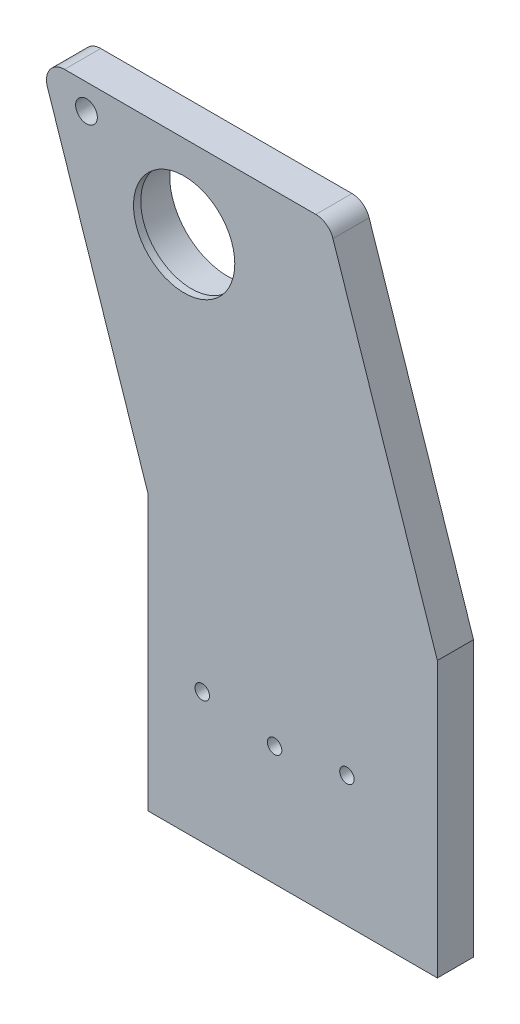
ISO-10303-21;
HEADER;
FILE_DESCRIPTION(('STEP AP214'),'2;1');
FILE_NAME('part.step','',(''),(''),'','','');
FILE_SCHEMA(('AUTOMOTIVE_DESIGN { 1 0 10303 214 1 1 1 1 }'));
ENDSEC;
DATA;
#1=APPLICATION_CONTEXT('core data for automotive mechanical design processes');
#2=APPLICATION_PROTOCOL_DEFINITION('international standard','automotive_design',2000,#1);
#3=PRODUCT_CONTEXT('',#1,'mechanical');
#4=PRODUCT('Part','Part','',(#3));
#5=PRODUCT_RELATED_PRODUCT_CATEGORY('part','',(#4));
#6=PRODUCT_DEFINITION_FORMATION('','',#4);
#7=PRODUCT_DEFINITION_CONTEXT('part definition',#1,'design');
#8=PRODUCT_DEFINITION('design','',#6,#7);
#9=PRODUCT_DEFINITION_SHAPE('','',#8);
#10=(LENGTH_UNIT() NAMED_UNIT(*) SI_UNIT(.MILLI.,.METRE.));
#11=(NAMED_UNIT(*) PLANE_ANGLE_UNIT() SI_UNIT($,.RADIAN.));
#12=(NAMED_UNIT(*) SI_UNIT($,.STERADIAN.) SOLID_ANGLE_UNIT());
#13=UNCERTAINTY_MEASURE_WITH_UNIT(LENGTH_MEASURE(1.E-05),#10,'distance_accuracy_value','');
#14=(GEOMETRIC_REPRESENTATION_CONTEXT(3) GLOBAL_UNCERTAINTY_ASSIGNED_CONTEXT((#13)) GLOBAL_UNIT_ASSIGNED_CONTEXT((#10,
#11,#12)) REPRESENTATION_CONTEXT('',''));
#15=CARTESIAN_POINT('',(0.,0.,0.));
#16=DIRECTION('',(0.,0.,1.));
#17=DIRECTION('',(1.,0.,0.));
#18=AXIS2_PLACEMENT_3D('',#15,#16,#17);
#19=CARTESIAN_POINT('',(-30.,60.,10.));
#20=DIRECTION('',(0.,0.,-1.));
#21=DIRECTION('',(-1.,0.,0.));
#22=AXIS2_PLACEMENT_3D('',#19,#20,#21);
#23=CYLINDRICAL_SURFACE('',#22,16.);
#24=CARTESIAN_POINT('',(-30.,60.,-2.));
#25=DIRECTION('',(0.,0.,1.));
#26=DIRECTION('',(1.,0.,0.));
#27=AXIS2_PLACEMENT_3D('',#24,#25,#26);
#28=CIRCLE('',#27,16.);
#29=CARTESIAN_POINT('',(-14.,60.,-2.));
#30=VERTEX_POINT('',#29);
#31=EDGE_CURVE('E187',#30,#30,#28,.T.);
#32=ORIENTED_EDGE('',*,*,#31,.F.);
#33=EDGE_LOOP('',(#32));
#34=FACE_BOUND('',#33,.T.);
#35=CARTESIAN_POINT('',(-30.,60.,8.));
#36=DIRECTION('',(0.,0.,1.));
#37=DIRECTION('',(1.,0.,0.));
#38=AXIS2_PLACEMENT_3D('',#35,#36,#37);
#39=CIRCLE('',#38,16.);
#40=CARTESIAN_POINT('',(-14.,60.,8.));
#41=VERTEX_POINT('',#40);
#42=EDGE_CURVE('E214',#41,#41,#39,.T.);
#43=ORIENTED_EDGE('',*,*,#42,.T.);
#44=EDGE_LOOP('',(#43));
#45=FACE_BOUND('',#44,.T.);
#46=ADVANCED_FACE('F36',(#34,#45),#23,.F.);
#47=CARTESIAN_POINT('',(0.,0.,10.));
#48=DIRECTION('',(0.,0.,-1.));
#49=DIRECTION('',(-1.,0.,0.));
#50=AXIS2_PLACEMENT_3D('',#47,#48,#49);
#51=PLANE('',#50);
#52=CARTESIAN_POINT('',(-5.00000000000003,-49.9999999999999,10.));
#53=DIRECTION('',(0.,0.,-1.));
#54=DIRECTION('',(-1.,0.,0.));
#55=AXIS2_PLACEMENT_3D('',#52,#53,#54);
#56=CIRCLE('',#55,2.);
#57=CARTESIAN_POINT('',(-7.00000000000003,-49.9999999999999,10.));
#58=VERTEX_POINT('',#57);
#59=EDGE_CURVE('E206',#58,#58,#56,.F.);
#60=ORIENTED_EDGE('',*,*,#59,.F.);
#61=EDGE_LOOP('',(#60));
#62=FACE_BOUND('',#61,.T.);
#63=CARTESIAN_POINT('',(-57.,76.,10.));
#64=DIRECTION('',(0.,0.,1.));
#65=DIRECTION('',(1.,0.,0.));
#66=AXIS2_PLACEMENT_3D('',#63,#64,#65);
#67=CIRCLE('',#66,3.);
#68=CARTESIAN_POINT('',(-54.,76.,10.));
#69=VERTEX_POINT('',#68);
#70=EDGE_CURVE('E195',#69,#69,#67,.T.);
#71=ORIENTED_EDGE('',*,*,#70,.F.);
#72=EDGE_LOOP('',(#71));
#73=FACE_BOUND('',#72,.T.);
#74=CARTESIAN_POINT('',(-25.,-47.,10.));
#75=DIRECTION('',(0.,0.,1.));
#76=DIRECTION('',(1.,0.,0.));
#77=AXIS2_PLACEMENT_3D('',#74,#75,#76);
#78=CIRCLE('',#77,2.);
#79=CARTESIAN_POINT('',(-23.,-47.,10.));
#80=VERTEX_POINT('',#79);
#81=EDGE_CURVE('E198',#80,#80,#78,.T.);
#82=ORIENTED_EDGE('',*,*,#81,.F.);
#83=EDGE_LOOP('',(#82));
#84=FACE_BOUND('',#83,.T.);
#85=CARTESIAN_POINT('',(15.,-47.,10.));
#86=DIRECTION('',(0.,0.,1.));
#87=DIRECTION('',(1.,0.,0.));
#88=AXIS2_PLACEMENT_3D('',#85,#86,#87);
#89=CIRCLE('',#88,2.);
#90=CARTESIAN_POINT('',(17.,-47.,10.));
#91=VERTEX_POINT('',#90);
#92=EDGE_CURVE('E191',#91,#91,#89,.T.);
#93=ORIENTED_EDGE('',*,*,#92,.F.);
#94=EDGE_LOOP('',(#93));
#95=FACE_BOUND('',#94,.T.);
#96=DIRECTION('',(-0.316227766016838,0.948683298050514,0.));
#97=VECTOR('',#96,1.);
#98=CARTESIAN_POINT('',(9.99999999999998,83.,10.));
#99=LINE('',#98,#97);
#100=CARTESIAN_POINT('',(40.,-7.00000000000001,10.));
#101=VERTEX_POINT('',#100);
#102=CARTESIAN_POINT('',(11.1396203899719,79.5811388300842,10.));
#103=VERTEX_POINT('',#102);
#104=EDGE_CURVE('E149',#101,#103,#99,.T.);
#105=ORIENTED_EDGE('',*,*,#104,.T.);
#106=CARTESIAN_POINT('',(6.39620389971937,78.,10.));
#107=DIRECTION('',(0.,0.,-1.));
#108=DIRECTION('',(-1.,0.,0.));
#109=AXIS2_PLACEMENT_3D('',#106,#107,#108);
#110=CIRCLE('',#109,5.);
#111=CARTESIAN_POINT('',(6.39620389971937,83.,10.));
#112=VERTEX_POINT('',#111);
#113=EDGE_CURVE('E44',#103,#112,#110,.F.);
#114=ORIENTED_EDGE('',*,*,#113,.T.);
#115=DIRECTION('',(-1.,0.,0.));
#116=VECTOR('',#115,1.);
#117=CARTESIAN_POINT('',(9.99999999999998,83.,10.));
#118=LINE('',#117,#116);
#119=CARTESIAN_POINT('',(-63.062870566386,83.,10.));
#120=VERTEX_POINT('',#119);
#121=EDGE_CURVE('E148',#112,#120,#118,.T.);
#122=ORIENTED_EDGE('',*,*,#121,.T.);
#123=CARTESIAN_POINT('',(-63.062870566386,78.,10.));
#124=DIRECTION('',(0.,0.,-1.));
#125=DIRECTION('',(-1.,0.,0.));
#126=AXIS2_PLACEMENT_3D('',#123,#124,#125);
#127=CIRCLE('',#126,5.);
#128=CARTESIAN_POINT('',(-67.8062870566386,76.4188611699158,10.));
#129=VERTEX_POINT('',#128);
#130=EDGE_CURVE('E51',#120,#129,#127,.F.);
#131=ORIENTED_EDGE('',*,*,#130,.T.);
#132=DIRECTION('',(0.316227766016838,-0.948683298050514,0.));
#133=VECTOR('',#132,1.);
#134=CARTESIAN_POINT('',(-70.,83.,10.));
#135=LINE('',#134,#133);
#136=CARTESIAN_POINT('',(-40.,-7.00000000000001,9.99999999999999));
#137=VERTEX_POINT('',#136);
#138=EDGE_CURVE('E119',#129,#137,#135,.T.);
#139=ORIENTED_EDGE('',*,*,#138,.T.);
#140=DIRECTION('',(0.,-1.,0.));
#141=VECTOR('',#140,1.);
#142=CARTESIAN_POINT('',(-40.,-7.00000000000001,9.99999999999999));
#143=LINE('',#142,#141);
#144=CARTESIAN_POINT('',(-40.,-83.,9.99999999999999));
#145=VERTEX_POINT('',#144);
#146=EDGE_CURVE('E114',#137,#145,#143,.T.);
#147=ORIENTED_EDGE('',*,*,#146,.T.);
#148=DIRECTION('',(1.,0.,0.));
#149=VECTOR('',#148,1.);
#150=CARTESIAN_POINT('',(40.,-83.,10.));
#151=LINE('',#150,#149);
#152=CARTESIAN_POINT('',(40.,-83.,10.));
#153=VERTEX_POINT('',#152);
#154=EDGE_CURVE('E104',#145,#153,#151,.T.);
#155=ORIENTED_EDGE('',*,*,#154,.T.);
#156=DIRECTION('',(0.,1.,0.));
#157=VECTOR('',#156,1.);
#158=CARTESIAN_POINT('',(40.,-7.00000000000001,10.));
#159=LINE('',#158,#157);
#160=EDGE_CURVE('E113',#153,#101,#159,.T.);
#161=ORIENTED_EDGE('',*,*,#160,.T.);
#162=EDGE_LOOP('',(#105,#114,#122,#131,#139,#147,#155,#161));
#163=FACE_BOUND('',#162,.T.);
#164=CARTESIAN_POINT('',(-30.,60.,10.));
#165=DIRECTION('',(0.,0.,1.));
#166=DIRECTION('',(1.,0.,0.));
#167=AXIS2_PLACEMENT_3D('',#164,#165,#166);
#168=CIRCLE('',#167,14.);
#169=CARTESIAN_POINT('',(-16.,60.,10.));
#170=VERTEX_POINT('',#169);
#171=EDGE_CURVE('E217',#170,#170,#168,.T.);
#172=ORIENTED_EDGE('',*,*,#171,.F.);
#173=EDGE_LOOP('',(#172));
#174=FACE_BOUND('',#173,.T.);
#175=ADVANCED_FACE('F117',(#62,#73,#84,#95,#163,#174),#51,.F.);
#176=CARTESIAN_POINT('',(0.,0.,0.));
#177=DIRECTION('',(0.,0.,-1.));
#178=DIRECTION('',(-1.,0.,0.));
#179=AXIS2_PLACEMENT_3D('',#176,#177,#178);
#180=PLANE('',#179);
#181=CARTESIAN_POINT('',(-5.00000000000003,-49.9999999999999,0.));
#182=DIRECTION('',(0.,0.,-1.));
#183=DIRECTION('',(-1.,0.,0.));
#184=AXIS2_PLACEMENT_3D('',#181,#182,#183);
#185=CIRCLE('',#184,2.);
#186=CARTESIAN_POINT('',(-7.00000000000003,-49.9999999999999,0.));
#187=VERTEX_POINT('',#186);
#188=EDGE_CURVE('E211',#187,#187,#185,.T.);
#189=ORIENTED_EDGE('',*,*,#188,.F.);
#190=EDGE_LOOP('',(#189));
#191=FACE_BOUND('',#190,.T.);
#192=CARTESIAN_POINT('',(-57.,76.,0.));
#193=DIRECTION('',(0.,0.,-1.));
#194=DIRECTION('',(-1.,0.,0.));
#195=AXIS2_PLACEMENT_3D('',#192,#193,#194);
#196=CIRCLE('',#195,3.);
#197=CARTESIAN_POINT('',(-60.,76.,0.));
#198=VERTEX_POINT('',#197);
#199=EDGE_CURVE('E203',#198,#198,#196,.F.);
#200=ORIENTED_EDGE('',*,*,#199,.T.);
#201=EDGE_LOOP('',(#200));
#202=FACE_BOUND('',#201,.T.);
#203=CARTESIAN_POINT('',(-25.,-47.,0.));
#204=DIRECTION('',(0.,0.,1.));
#205=DIRECTION('',(1.,0.,0.));
#206=AXIS2_PLACEMENT_3D('',#203,#204,#205);
#207=CIRCLE('',#206,2.);
#208=CARTESIAN_POINT('',(-23.,-47.,0.));
#209=VERTEX_POINT('',#208);
#210=EDGE_CURVE('E190',#209,#209,#207,.T.);
#211=ORIENTED_EDGE('',*,*,#210,.T.);
#212=EDGE_LOOP('',(#211));
#213=FACE_BOUND('',#212,.T.);
#214=CARTESIAN_POINT('',(15.,-47.,0.));
#215=DIRECTION('',(0.,0.,1.));
#216=DIRECTION('',(1.,0.,0.));
#217=AXIS2_PLACEMENT_3D('',#214,#215,#216);
#218=CIRCLE('',#217,2.);
#219=CARTESIAN_POINT('',(17.,-47.,0.));
#220=VERTEX_POINT('',#219);
#221=EDGE_CURVE('E194',#220,#220,#218,.T.);
#222=ORIENTED_EDGE('',*,*,#221,.T.);
#223=EDGE_LOOP('',(#222));
#224=FACE_BOUND('',#223,.T.);
#225=CARTESIAN_POINT('',(-30.,60.,0.));
#226=DIRECTION('',(0.,0.,-1.));
#227=DIRECTION('',(-1.,0.,0.));
#228=AXIS2_PLACEMENT_3D('',#225,#226,#227);
#229=CIRCLE('',#228,18.);
#230=CARTESIAN_POINT('',(-48.,60.,0.));
#231=VERTEX_POINT('',#230);
#232=EDGE_CURVE('E128',#231,#231,#229,.T.);
#233=ORIENTED_EDGE('',*,*,#232,.F.);
#234=EDGE_LOOP('',(#233));
#235=FACE_BOUND('',#234,.T.);
#236=DIRECTION('',(-1.,0.,0.));
#237=VECTOR('',#236,1.);
#238=CARTESIAN_POINT('',(-40.,83.,0.));
#239=LINE('',#238,#237);
#240=CARTESIAN_POINT('',(6.39620389971937,83.,0.));
#241=VERTEX_POINT('',#240);
#242=CARTESIAN_POINT('',(-63.062870566386,83.,0.));
#243=VERTEX_POINT('',#242);
#244=EDGE_CURVE('E164',#241,#243,#239,.T.);
#245=ORIENTED_EDGE('',*,*,#244,.F.);
#246=CARTESIAN_POINT('',(6.39620389971937,78.,0.));
#247=DIRECTION('',(0.,0.,-1.));
#248=DIRECTION('',(-1.,0.,0.));
#249=AXIS2_PLACEMENT_3D('',#246,#247,#248);
#250=CIRCLE('',#249,5.);
#251=CARTESIAN_POINT('',(11.1396203899719,79.5811388300842,0.));
#252=VERTEX_POINT('',#251);
#253=EDGE_CURVE('E143',#241,#252,#250,.T.);
#254=ORIENTED_EDGE('',*,*,#253,.T.);
#255=DIRECTION('',(-0.316227766016838,0.948683298050514,0.));
#256=VECTOR('',#255,1.);
#257=CARTESIAN_POINT('',(9.99999999999998,83.,0.));
#258=LINE('',#257,#256);
#259=CARTESIAN_POINT('',(40.,-7.00000000000001,0.));
#260=VERTEX_POINT('',#259);
#261=EDGE_CURVE('E163',#260,#252,#258,.T.);
#262=ORIENTED_EDGE('',*,*,#261,.F.);
#263=DIRECTION('',(0.,1.,0.));
#264=VECTOR('',#263,1.);
#265=CARTESIAN_POINT('',(40.,-7.00000000000001,0.));
#266=LINE('',#265,#264);
#267=CARTESIAN_POINT('',(40.,-83.,0.));
#268=VERTEX_POINT('',#267);
#269=EDGE_CURVE('E168',#268,#260,#266,.T.);
#270=ORIENTED_EDGE('',*,*,#269,.F.);
#271=DIRECTION('',(1.,0.,0.));
#272=VECTOR('',#271,1.);
#273=CARTESIAN_POINT('',(40.,-83.,0.));
#274=LINE('',#273,#272);
#275=CARTESIAN_POINT('',(-40.,-83.,0.));
#276=VERTEX_POINT('',#275);
#277=EDGE_CURVE('E171',#276,#268,#274,.T.);
#278=ORIENTED_EDGE('',*,*,#277,.F.);
#279=DIRECTION('',(0.,-1.,0.));
#280=VECTOR('',#279,1.);
#281=CARTESIAN_POINT('',(-40.,-7.00000000000001,0.));
#282=LINE('',#281,#280);
#283=CARTESIAN_POINT('',(-40.,-7.00000000000001,0.));
#284=VERTEX_POINT('',#283);
#285=EDGE_CURVE('E127',#284,#276,#282,.T.);
#286=ORIENTED_EDGE('',*,*,#285,.F.);
#287=DIRECTION('',(0.316227766016838,-0.948683298050514,0.));
#288=VECTOR('',#287,1.);
#289=CARTESIAN_POINT('',(-70.,83.,0.));
#290=LINE('',#289,#288);
#291=CARTESIAN_POINT('',(-67.8062870566386,76.4188611699158,0.));
#292=VERTEX_POINT('',#291);
#293=EDGE_CURVE('E123',#292,#284,#290,.T.);
#294=ORIENTED_EDGE('',*,*,#293,.F.);
#295=CARTESIAN_POINT('',(-63.062870566386,78.,0.));
#296=DIRECTION('',(0.,0.,-1.));
#297=DIRECTION('',(-1.,0.,0.));
#298=AXIS2_PLACEMENT_3D('',#295,#296,#297);
#299=CIRCLE('',#298,5.);
#300=EDGE_CURVE('E141',#292,#243,#299,.T.);
#301=ORIENTED_EDGE('',*,*,#300,.T.);
#302=EDGE_LOOP('',(#245,#254,#262,#270,#278,#286,#294,#301));
#303=FACE_BOUND('',#302,.T.);
#304=ADVANCED_FACE('F161',(#191,#202,#213,#224,#235,#303),#180,.T.);
#305=CARTESIAN_POINT('',(-40.,-7.00000000000001,9.99999999999999));
#306=DIRECTION('',(1.,0.,0.));
#307=DIRECTION('',(0.,1.,0.));
#308=AXIS2_PLACEMENT_3D('',#305,#306,#307);
#309=PLANE('',#308);
#310=ORIENTED_EDGE('',*,*,#285,.T.);
#311=DIRECTION('',(0.,0.,-1.));
#312=VECTOR('',#311,1.);
#313=CARTESIAN_POINT('',(-40.,-83.,9.99999999999999));
#314=LINE('',#313,#312);
#315=EDGE_CURVE('E108',#145,#276,#314,.T.);
#316=ORIENTED_EDGE('',*,*,#315,.F.);
#317=ORIENTED_EDGE('',*,*,#146,.F.);
#318=DIRECTION('',(0.,0.,-1.));
#319=VECTOR('',#318,1.);
#320=CARTESIAN_POINT('',(-40.,-7.00000000000001,9.99999999999999));
#321=LINE('',#320,#319);
#322=EDGE_CURVE('E176',#137,#284,#321,.T.);
#323=ORIENTED_EDGE('',*,*,#322,.T.);
#324=EDGE_LOOP('',(#310,#316,#317,#323));
#325=FACE_BOUND('',#324,.T.);
#326=ADVANCED_FACE('F125',(#325),#309,.F.);
#327=CARTESIAN_POINT('',(40.,-83.,10.));
#328=DIRECTION('',(0.,1.,0.));
#329=DIRECTION('',(0.,0.,1.));
#330=AXIS2_PLACEMENT_3D('',#327,#328,#329);
#331=PLANE('',#330);
#332=ORIENTED_EDGE('',*,*,#277,.T.);
#333=DIRECTION('',(0.,0.,-1.));
#334=VECTOR('',#333,1.);
#335=CARTESIAN_POINT('',(40.,-83.,10.));
#336=LINE('',#335,#334);
#337=EDGE_CURVE('E111',#153,#268,#336,.T.);
#338=ORIENTED_EDGE('',*,*,#337,.F.);
#339=ORIENTED_EDGE('',*,*,#154,.F.);
#340=ORIENTED_EDGE('',*,*,#315,.T.);
#341=EDGE_LOOP('',(#332,#338,#339,#340));
#342=FACE_BOUND('',#341,.T.);
#343=ADVANCED_FACE('F106',(#342),#331,.F.);
#344=CARTESIAN_POINT('',(40.,-7.00000000000001,10.));
#345=DIRECTION('',(-1.,0.,0.));
#346=DIRECTION('',(0.,0.,1.));
#347=AXIS2_PLACEMENT_3D('',#344,#345,#346);
#348=PLANE('',#347);
#349=ORIENTED_EDGE('',*,*,#269,.T.);
#350=DIRECTION('',(0.,0.,-1.));
#351=VECTOR('',#350,1.);
#352=CARTESIAN_POINT('',(40.,-7.00000000000001,10.));
#353=LINE('',#352,#351);
#354=EDGE_CURVE('E133',#101,#260,#353,.T.);
#355=ORIENTED_EDGE('',*,*,#354,.F.);
#356=ORIENTED_EDGE('',*,*,#160,.F.);
#357=ORIENTED_EDGE('',*,*,#337,.T.);
#358=EDGE_LOOP('',(#349,#355,#356,#357));
#359=FACE_BOUND('',#358,.T.);
#360=ADVANCED_FACE('F182',(#359),#348,.F.);
#361=CARTESIAN_POINT('',(9.99999999999998,83.,10.));
#362=DIRECTION('',(-0.948683298050514,-0.316227766016838,0.));
#363=DIRECTION('',(0.316227766016838,-0.948683298050514,0.));
#364=AXIS2_PLACEMENT_3D('',#361,#362,#363);
#365=PLANE('',#364);
#366=ORIENTED_EDGE('',*,*,#261,.T.);
#367=DIRECTION('',(0.,0.,-1.));
#368=VECTOR('',#367,1.);
#369=CARTESIAN_POINT('',(11.1396203899719,79.5811388300842,10.));
#370=LINE('',#369,#368);
#371=EDGE_CURVE('E59',#252,#103,#370,.F.);
#372=ORIENTED_EDGE('',*,*,#371,.T.);
#373=ORIENTED_EDGE('',*,*,#104,.F.);
#374=ORIENTED_EDGE('',*,*,#354,.T.);
#375=EDGE_LOOP('',(#366,#372,#373,#374));
#376=FACE_BOUND('',#375,.T.);
#377=ADVANCED_FACE('F166',(#376),#365,.F.);
#378=CARTESIAN_POINT('',(-40.,83.,9.99999999999999));
#379=DIRECTION('',(0.,-1.,0.));
#380=DIRECTION('',(0.,0.,-1.));
#381=AXIS2_PLACEMENT_3D('',#378,#379,#380);
#382=PLANE('',#381);
#383=ORIENTED_EDGE('',*,*,#121,.F.);
#384=DIRECTION('',(0.,0.,-1.));
#385=VECTOR('',#384,1.);
#386=CARTESIAN_POINT('',(6.39620389971937,83.,10.));
#387=LINE('',#386,#385);
#388=EDGE_CURVE('E138',#112,#241,#387,.T.);
#389=ORIENTED_EDGE('',*,*,#388,.T.);
#390=ORIENTED_EDGE('',*,*,#244,.T.);
#391=DIRECTION('',(0.,0.,-1.));
#392=VECTOR('',#391,1.);
#393=CARTESIAN_POINT('',(-63.062870566386,83.,10.));
#394=LINE('',#393,#392);
#395=EDGE_CURVE('E131',#243,#120,#394,.F.);
#396=ORIENTED_EDGE('',*,*,#395,.T.);
#397=EDGE_LOOP('',(#383,#389,#390,#396));
#398=FACE_BOUND('',#397,.T.);
#399=ADVANCED_FACE('F153',(#398),#382,.F.);
#400=CARTESIAN_POINT('',(-70.,83.,10.));
#401=DIRECTION('',(0.948683298050514,0.316227766016838,0.));
#402=DIRECTION('',(-0.316227766016838,0.948683298050514,0.));
#403=AXIS2_PLACEMENT_3D('',#400,#401,#402);
#404=PLANE('',#403);
#405=ORIENTED_EDGE('',*,*,#138,.F.);
#406=DIRECTION('',(0.,0.,-1.));
#407=VECTOR('',#406,1.);
#408=CARTESIAN_POINT('',(-67.8062870566386,76.4188611699158,10.));
#409=LINE('',#408,#407);
#410=EDGE_CURVE('E11',#129,#292,#409,.T.);
#411=ORIENTED_EDGE('',*,*,#410,.T.);
#412=ORIENTED_EDGE('',*,*,#293,.T.);
#413=ORIENTED_EDGE('',*,*,#322,.F.);
#414=EDGE_LOOP('',(#405,#411,#412,#413));
#415=FACE_BOUND('',#414,.T.);
#416=ADVANCED_FACE('F241',(#415),#404,.F.);
#417=CARTESIAN_POINT('',(-30.,60.,-2.));
#418=DIRECTION('',(0.,0.,1.));
#419=DIRECTION('',(1.,0.,0.));
#420=AXIS2_PLACEMENT_3D('',#417,#418,#419);
#421=CYLINDRICAL_SURFACE('',#420,18.);
#422=ORIENTED_EDGE('',*,*,#232,.T.);
#423=EDGE_LOOP('',(#422));
#424=FACE_BOUND('',#423,.T.);
#425=CARTESIAN_POINT('',(-30.,60.,-2.));
#426=DIRECTION('',(0.,0.,1.));
#427=DIRECTION('',(1.,0.,0.));
#428=AXIS2_PLACEMENT_3D('',#425,#426,#427);
#429=CIRCLE('',#428,18.);
#430=CARTESIAN_POINT('',(-12.,60.,-2.));
#431=VERTEX_POINT('',#430);
#432=EDGE_CURVE('E180',#431,#431,#429,.T.);
#433=ORIENTED_EDGE('',*,*,#432,.T.);
#434=EDGE_LOOP('',(#433));
#435=FACE_BOUND('',#434,.T.);
#436=ADVANCED_FACE('F244',(#424,#435),#421,.T.);
#437=CARTESIAN_POINT('',(-30.,60.,-2.));
#438=DIRECTION('',(0.,0.,1.));
#439=DIRECTION('',(1.,0.,0.));
#440=AXIS2_PLACEMENT_3D('',#437,#438,#439);
#441=PLANE('',#440);
#442=ORIENTED_EDGE('',*,*,#31,.T.);
#443=EDGE_LOOP('',(#442));
#444=FACE_BOUND('',#443,.T.);
#445=ORIENTED_EDGE('',*,*,#432,.F.);
#446=EDGE_LOOP('',(#445));
#447=FACE_BOUND('',#446,.T.);
#448=ADVANCED_FACE('F282',(#444,#447),#441,.F.);
#449=CARTESIAN_POINT('',(15.,-47.,0.));
#450=DIRECTION('',(0.,0.,1.));
#451=DIRECTION('',(1.,0.,0.));
#452=AXIS2_PLACEMENT_3D('',#449,#450,#451);
#453=CYLINDRICAL_SURFACE('',#452,2.);
#454=ORIENTED_EDGE('',*,*,#221,.F.);
#455=EDGE_LOOP('',(#454));
#456=FACE_BOUND('',#455,.T.);
#457=ORIENTED_EDGE('',*,*,#92,.T.);
#458=EDGE_LOOP('',(#457));
#459=FACE_BOUND('',#458,.T.);
#460=ADVANCED_FACE('F278',(#456,#459),#453,.F.);
#461=CARTESIAN_POINT('',(-25.,-47.,0.));
#462=DIRECTION('',(0.,0.,1.));
#463=DIRECTION('',(1.,0.,0.));
#464=AXIS2_PLACEMENT_3D('',#461,#462,#463);
#465=CYLINDRICAL_SURFACE('',#464,2.);
#466=ORIENTED_EDGE('',*,*,#210,.F.);
#467=EDGE_LOOP('',(#466));
#468=FACE_BOUND('',#467,.T.);
#469=ORIENTED_EDGE('',*,*,#81,.T.);
#470=EDGE_LOOP('',(#469));
#471=FACE_BOUND('',#470,.T.);
#472=ADVANCED_FACE('F269',(#468,#471),#465,.F.);
#473=CARTESIAN_POINT('',(-57.,76.,-2.00100000000001));
#474=DIRECTION('',(0.,0.,1.));
#475=DIRECTION('',(1.,0.,0.));
#476=AXIS2_PLACEMENT_3D('',#473,#474,#475);
#477=CYLINDRICAL_SURFACE('',#476,3.);
#478=ORIENTED_EDGE('',*,*,#199,.F.);
#479=EDGE_LOOP('',(#478));
#480=FACE_BOUND('',#479,.T.);
#481=ORIENTED_EDGE('',*,*,#70,.T.);
#482=EDGE_LOOP('',(#481));
#483=FACE_BOUND('',#482,.T.);
#484=ADVANCED_FACE('F263',(#480,#483),#477,.F.);
#485=CARTESIAN_POINT('',(-5.00000000000003,-49.9999999999999,10.001));
#486=DIRECTION('',(0.,0.,-1.));
#487=DIRECTION('',(-1.,0.,0.));
#488=AXIS2_PLACEMENT_3D('',#485,#486,#487);
#489=CYLINDRICAL_SURFACE('',#488,2.);
#490=ORIENTED_EDGE('',*,*,#188,.T.);
#491=EDGE_LOOP('',(#490));
#492=FACE_BOUND('',#491,.T.);
#493=ORIENTED_EDGE('',*,*,#59,.T.);
#494=EDGE_LOOP('',(#493));
#495=FACE_BOUND('',#494,.T.);
#496=ADVANCED_FACE('F256',(#492,#495),#489,.F.);
#497=CARTESIAN_POINT('',(6.39620389971937,78.,10.));
#498=DIRECTION('',(0.,0.,-1.));
#499=DIRECTION('',(-1.,0.,0.));
#500=AXIS2_PLACEMENT_3D('',#497,#498,#499);
#501=CYLINDRICAL_SURFACE('',#500,5.);
#502=ORIENTED_EDGE('',*,*,#113,.F.);
#503=ORIENTED_EDGE('',*,*,#371,.F.);
#504=ORIENTED_EDGE('',*,*,#253,.F.);
#505=ORIENTED_EDGE('',*,*,#388,.F.);
#506=EDGE_LOOP('',(#502,#503,#504,#505));
#507=FACE_BOUND('',#506,.T.);
#508=ADVANCED_FACE('F158',(#507),#501,.T.);
#509=CARTESIAN_POINT('',(-63.062870566386,78.,10.));
#510=DIRECTION('',(0.,0.,-1.));
#511=DIRECTION('',(-1.,0.,0.));
#512=AXIS2_PLACEMENT_3D('',#509,#510,#511);
#513=CYLINDRICAL_SURFACE('',#512,5.);
#514=ORIENTED_EDGE('',*,*,#130,.F.);
#515=ORIENTED_EDGE('',*,*,#395,.F.);
#516=ORIENTED_EDGE('',*,*,#300,.F.);
#517=ORIENTED_EDGE('',*,*,#410,.F.);
#518=EDGE_LOOP('',(#514,#515,#516,#517));
#519=FACE_BOUND('',#518,.T.);
#520=ADVANCED_FACE('F38',(#519),#513,.T.);
#521=CARTESIAN_POINT('',(-30.,60.,8.));
#522=DIRECTION('',(0.,0.,1.));
#523=DIRECTION('',(1.,0.,0.));
#524=AXIS2_PLACEMENT_3D('',#521,#522,#523);
#525=PLANE('',#524);
#526=ORIENTED_EDGE('',*,*,#42,.F.);
#527=EDGE_LOOP('',(#526));
#528=FACE_BOUND('',#527,.T.);
#529=CARTESIAN_POINT('',(-30.,60.,8.));
#530=DIRECTION('',(0.,0.,1.));
#531=DIRECTION('',(1.,0.,0.));
#532=AXIS2_PLACEMENT_3D('',#529,#530,#531);
#533=CIRCLE('',#532,14.);
#534=CARTESIAN_POINT('',(-16.,60.,8.));
#535=VERTEX_POINT('',#534);
#536=EDGE_CURVE('E218',#535,#535,#533,.T.);
#537=ORIENTED_EDGE('',*,*,#536,.T.);
#538=EDGE_LOOP('',(#537));
#539=FACE_BOUND('',#538,.T.);
#540=ADVANCED_FACE('F261',(#528,#539),#525,.F.);
#541=CARTESIAN_POINT('',(-30.,60.,10.));
#542=DIRECTION('',(0.,0.,-1.));
#543=DIRECTION('',(-1.,0.,0.));
#544=AXIS2_PLACEMENT_3D('',#541,#542,#543);
#545=CYLINDRICAL_SURFACE('',#544,14.);
#546=ORIENTED_EDGE('',*,*,#171,.T.);
#547=EDGE_LOOP('',(#546));
#548=FACE_BOUND('',#547,.T.);
#549=ORIENTED_EDGE('',*,*,#536,.F.);
#550=EDGE_LOOP('',(#549));
#551=FACE_BOUND('',#550,.T.);
#552=ADVANCED_FACE('F224',(#548,#551),#545,.F.);
#553=CLOSED_SHELL('',(#46,#175,#304,#326,#343,#360,#377,#399,#416,#436,#448,#460,#472,#484,#496,
#508,#520,#540,#552));
#554=MANIFOLD_SOLID_BREP('B2',#553);
#555=ADVANCED_BREP_SHAPE_REPRESENTATION('',(#18,#554),#14);
#556=SHAPE_DEFINITION_REPRESENTATION(#9,#555);
ENDSEC;
END-ISO-10303-21;
